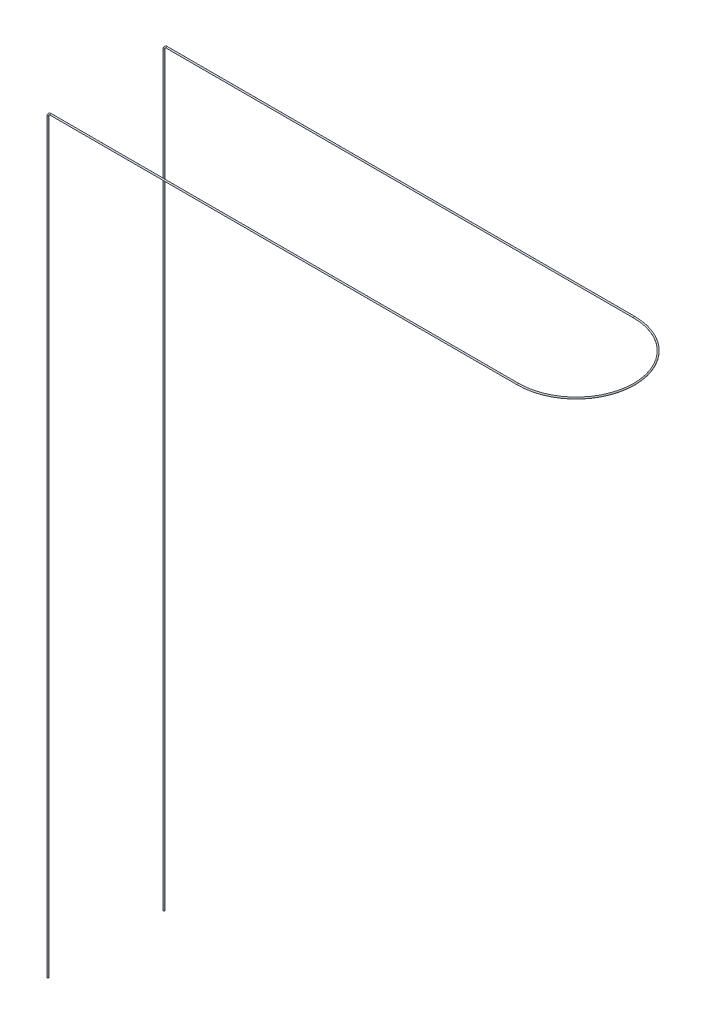
ISO-10303-21;
HEADER;
FILE_DESCRIPTION(('STEP AP214'),'2;1');
FILE_NAME('part.step','',(''),(''),'','','');
FILE_SCHEMA(('AUTOMOTIVE_DESIGN { 1 0 10303 214 1 1 1 1 }'));
ENDSEC;
DATA;
#1=APPLICATION_CONTEXT('core data for automotive mechanical design processes');
#2=APPLICATION_PROTOCOL_DEFINITION('international standard','automotive_design',2000,#1);
#3=PRODUCT_CONTEXT('',#1,'mechanical');
#4=PRODUCT('Part','Part','',(#3));
#5=PRODUCT_RELATED_PRODUCT_CATEGORY('part','',(#4));
#6=PRODUCT_DEFINITION_FORMATION('','',#4);
#7=PRODUCT_DEFINITION_CONTEXT('part definition',#1,'design');
#8=PRODUCT_DEFINITION('design','',#6,#7);
#9=PRODUCT_DEFINITION_SHAPE('','',#8);
#10=(LENGTH_UNIT() NAMED_UNIT(*) SI_UNIT(.MILLI.,.METRE.));
#11=(NAMED_UNIT(*) PLANE_ANGLE_UNIT() SI_UNIT($,.RADIAN.));
#12=(NAMED_UNIT(*) SI_UNIT($,.STERADIAN.) SOLID_ANGLE_UNIT());
#13=UNCERTAINTY_MEASURE_WITH_UNIT(LENGTH_MEASURE(1.E-05),#10,'distance_accuracy_value','');
#14=(GEOMETRIC_REPRESENTATION_CONTEXT(3) GLOBAL_UNCERTAINTY_ASSIGNED_CONTEXT((#13)) GLOBAL_UNIT_ASSIGNED_CONTEXT((#10,
#11,#12)) REPRESENTATION_CONTEXT('',''));
#15=CARTESIAN_POINT('',(0.,0.,0.));
#16=DIRECTION('',(0.,0.,1.));
#17=DIRECTION('',(1.,0.,0.));
#18=AXIS2_PLACEMENT_3D('',#15,#16,#17);
#19=CARTESIAN_POINT('',(0.,0.,0.));
#20=DIRECTION('',(0.,-1.,0.));
#21=DIRECTION('',(0.,0.,-1.));
#22=AXIS2_PLACEMENT_3D('',#19,#20,#21);
#23=PLANE('',#22);
#24=CARTESIAN_POINT('',(0.,0.,0.));
#25=DIRECTION('',(0.,-1.,0.));
#26=DIRECTION('',(0.,0.,-1.));
#27=AXIS2_PLACEMENT_3D('',#24,#25,#26);
#28=CIRCLE('',#27,0.25);
#29=CARTESIAN_POINT('',(0.,0.,-0.25));
#30=VERTEX_POINT('',#29);
#31=EDGE_CURVE('E84',#30,#30,#28,.T.);
#32=ORIENTED_EDGE('',*,*,#31,.T.);
#33=EDGE_LOOP('',(#32));
#34=FACE_BOUND('',#33,.T.);
#35=ADVANCED_FACE('F49',(#34),#23,.T.);
#36=CARTESIAN_POINT('',(0.,0.,-40.0000000000001));
#37=DIRECTION('',(0.,1.,0.));
#38=DIRECTION('',(0.,0.,1.));
#39=AXIS2_PLACEMENT_3D('',#36,#37,#38);
#40=PLANE('',#39);
#41=CARTESIAN_POINT('',(0.,0.,-40.0000000000001));
#42=DIRECTION('',(0.,1.,0.));
#43=DIRECTION('',(0.,0.,1.));
#44=AXIS2_PLACEMENT_3D('',#41,#42,#43);
#45=CIRCLE('',#44,0.25);
#46=CARTESIAN_POINT('',(0.,0.,-39.7500000000001));
#47=VERTEX_POINT('',#46);
#48=EDGE_CURVE('E11',#47,#47,#45,.T.);
#49=ORIENTED_EDGE('',*,*,#48,.F.);
#50=EDGE_LOOP('',(#49));
#51=FACE_BOUND('',#50,.T.);
#52=ADVANCED_FACE('F93',(#51),#40,.F.);
#53=CARTESIAN_POINT('',(0.,0.,0.));
#54=DIRECTION('',(0.,1.,0.));
#55=DIRECTION('',(-1.,0.,0.));
#56=AXIS2_PLACEMENT_3D('',#53,#54,#55);
#57=CYLINDRICAL_SURFACE('',#56,0.25);
#58=CARTESIAN_POINT('',(0.,257.,0.));
#59=DIRECTION('',(0.,-1.,0.));
#60=DIRECTION('',(0.,0.,-1.));
#61=AXIS2_PLACEMENT_3D('',#58,#59,#60);
#62=CIRCLE('',#61,0.25);
#63=CARTESIAN_POINT('',(-0.250000000000012,257.,0.));
#64=VERTEX_POINT('',#63);
#65=EDGE_CURVE('E80',#64,#64,#62,.T.);
#66=ORIENTED_EDGE('',*,*,#65,.T.);
#67=EDGE_LOOP('',(#66));
#68=FACE_BOUND('',#67,.T.);
#69=ORIENTED_EDGE('',*,*,#31,.F.);
#70=EDGE_LOOP('',(#69));
#71=FACE_BOUND('',#70,.T.);
#72=ADVANCED_FACE('F90',(#68,#71),#57,.T.);
#73=CARTESIAN_POINT('',(0.999999999999989,257.,0.));
#74=DIRECTION('',(0.,0.,-1.));
#75=DIRECTION('',(-1.,0.,0.));
#76=AXIS2_PLACEMENT_3D('',#73,#74,#75);
#77=TOROIDAL_SURFACE('',#76,1.,0.25);
#78=CARTESIAN_POINT('',(0.999999999999988,258.,0.));
#79=DIRECTION('',(-1.,0.,0.));
#80=DIRECTION('',(0.,0.,-1.));
#81=AXIS2_PLACEMENT_3D('',#78,#79,#80);
#82=CIRCLE('',#81,0.25);
#83=CARTESIAN_POINT('',(0.999999999999988,258.25,0.));
#84=VERTEX_POINT('',#83);
#85=EDGE_CURVE('E76',#84,#84,#82,.T.);
#86=CARTESIAN_POINT('',(0.999999999999989,257.,0.));
#87=DIRECTION('',(0.,0.,-1.));
#88=DIRECTION('',(-1.,0.,0.));
#89=AXIS2_PLACEMENT_3D('',#86,#87,#88);
#90=CIRCLE('',#89,1.25);
#91=EDGE_CURVE('',#64,#84,#90,.T.);
#92=ORIENTED_EDGE('',*,*,#65,.F.);
#93=ORIENTED_EDGE('',*,*,#85,.T.);
#94=ORIENTED_EDGE('',*,*,#91,.T.);
#95=ORIENTED_EDGE('',*,*,#91,.F.);
#96=EDGE_LOOP('',(#92,#94,#93,#95));
#97=FACE_BOUND('',#96,.T.);
#98=ADVANCED_FACE('F92',(#97),#77,.T.);
#99=CARTESIAN_POINT('',(0.999999999999989,258.,0.));
#100=DIRECTION('',(1.,0.,0.));
#101=DIRECTION('',(0.,1.,0.));
#102=AXIS2_PLACEMENT_3D('',#99,#100,#101);
#103=CYLINDRICAL_SURFACE('',#102,0.25);
#104=CARTESIAN_POINT('',(162.,258.,0.));
#105=DIRECTION('',(-1.,0.,0.));
#106=DIRECTION('',(0.,0.,-1.));
#107=AXIS2_PLACEMENT_3D('',#104,#105,#106);
#108=CIRCLE('',#107,0.25);
#109=CARTESIAN_POINT('',(162.,258.,0.249999999999993));
#110=VERTEX_POINT('',#109);
#111=EDGE_CURVE('E72',#110,#110,#108,.T.);
#112=ORIENTED_EDGE('',*,*,#111,.T.);
#113=EDGE_LOOP('',(#112));
#114=FACE_BOUND('',#113,.T.);
#115=ORIENTED_EDGE('',*,*,#85,.F.);
#116=EDGE_LOOP('',(#115));
#117=FACE_BOUND('',#116,.T.);
#118=ADVANCED_FACE('F100',(#114,#117),#103,.T.);
#119=CARTESIAN_POINT('',(162.,258.,-20.));
#120=DIRECTION('',(0.,1.,0.));
#121=DIRECTION('',(0.,0.,1.));
#122=AXIS2_PLACEMENT_3D('',#119,#120,#121);
#123=TOROIDAL_SURFACE('',#122,20.,0.25);
#124=CARTESIAN_POINT('',(162.,258.,-40.));
#125=DIRECTION('',(1.,0.,0.));
#126=DIRECTION('',(0.,0.,1.));
#127=AXIS2_PLACEMENT_3D('',#124,#125,#126);
#128=CIRCLE('',#127,0.25);
#129=CARTESIAN_POINT('',(162.,258.,-40.25));
#130=VERTEX_POINT('',#129);
#131=EDGE_CURVE('E66',#130,#130,#128,.T.);
#132=CARTESIAN_POINT('',(162.,258.,-20.));
#133=DIRECTION('',(0.,1.,0.));
#134=DIRECTION('',(0.,0.,1.));
#135=AXIS2_PLACEMENT_3D('',#132,#133,#134);
#136=CIRCLE('',#135,20.25);
#137=EDGE_CURVE('',#110,#130,#136,.T.);
#138=ORIENTED_EDGE('',*,*,#111,.F.);
#139=ORIENTED_EDGE('',*,*,#131,.T.);
#140=ORIENTED_EDGE('',*,*,#137,.T.);
#141=ORIENTED_EDGE('',*,*,#137,.F.);
#142=EDGE_LOOP('',(#138,#140,#139,#141));
#143=FACE_BOUND('',#142,.T.);
#144=ADVANCED_FACE('F117',(#143),#123,.T.);
#145=CARTESIAN_POINT('',(162.,258.,-40.));
#146=DIRECTION('',(-1.,0.,0.));
#147=DIRECTION('',(0.,-1.,0.));
#148=AXIS2_PLACEMENT_3D('',#145,#146,#147);
#149=CYLINDRICAL_SURFACE('',#148,0.25);
#150=CARTESIAN_POINT('',(1.,258.,-40.));
#151=DIRECTION('',(1.,0.,0.));
#152=DIRECTION('',(0.,0.,1.));
#153=AXIS2_PLACEMENT_3D('',#150,#151,#152);
#154=CIRCLE('',#153,0.25);
#155=CARTESIAN_POINT('',(1.,258.25,-40.));
#156=VERTEX_POINT('',#155);
#157=EDGE_CURVE('E61',#156,#156,#154,.T.);
#158=ORIENTED_EDGE('',*,*,#157,.T.);
#159=EDGE_LOOP('',(#158));
#160=FACE_BOUND('',#159,.T.);
#161=ORIENTED_EDGE('',*,*,#131,.F.);
#162=EDGE_LOOP('',(#161));
#163=FACE_BOUND('',#162,.T.);
#164=ADVANCED_FACE('F111',(#160,#163),#149,.T.);
#165=CARTESIAN_POINT('',(1.,257.,-40.));
#166=DIRECTION('',(0.,0.,1.));
#167=DIRECTION('',(1.,0.,0.));
#168=AXIS2_PLACEMENT_3D('',#165,#166,#167);
#169=TOROIDAL_SURFACE('',#168,1.,0.25);
#170=CARTESIAN_POINT('',(0.,257.,-40.));
#171=DIRECTION('',(0.,1.,0.));
#172=DIRECTION('',(0.,0.,1.));
#173=AXIS2_PLACEMENT_3D('',#170,#171,#172);
#174=CIRCLE('',#173,0.25);
#175=CARTESIAN_POINT('',(-0.25,257.,-40.));
#176=VERTEX_POINT('',#175);
#177=EDGE_CURVE('E56',#176,#176,#174,.T.);
#178=CARTESIAN_POINT('',(1.,257.,-40.));
#179=DIRECTION('',(0.,0.,1.));
#180=DIRECTION('',(1.,0.,0.));
#181=AXIS2_PLACEMENT_3D('',#178,#179,#180);
#182=CIRCLE('',#181,1.25);
#183=EDGE_CURVE('',#156,#176,#182,.T.);
#184=ORIENTED_EDGE('',*,*,#157,.F.);
#185=ORIENTED_EDGE('',*,*,#177,.T.);
#186=ORIENTED_EDGE('',*,*,#183,.T.);
#187=ORIENTED_EDGE('',*,*,#183,.F.);
#188=EDGE_LOOP('',(#184,#186,#185,#187));
#189=FACE_BOUND('',#188,.T.);
#190=ADVANCED_FACE('F106',(#189),#169,.T.);
#191=CARTESIAN_POINT('',(0.,257.,-40.));
#192=DIRECTION('',(0.,-1.,0.));
#193=DIRECTION('',(0.,0.,-1.));
#194=AXIS2_PLACEMENT_3D('',#191,#192,#193);
#195=CYLINDRICAL_SURFACE('',#194,0.25);
#196=ORIENTED_EDGE('',*,*,#48,.T.);
#197=EDGE_LOOP('',(#196));
#198=FACE_BOUND('',#197,.T.);
#199=ORIENTED_EDGE('',*,*,#177,.F.);
#200=EDGE_LOOP('',(#199));
#201=FACE_BOUND('',#200,.T.);
#202=ADVANCED_FACE('F104',(#198,#201),#195,.T.);
#203=CLOSED_SHELL('',(#35,#52,#72,#98,#118,#144,#164,#190,#202));
#204=MANIFOLD_SOLID_BREP('B2',#203);
#205=ADVANCED_BREP_SHAPE_REPRESENTATION('',(#18,#204),#14);
#206=SHAPE_DEFINITION_REPRESENTATION(#9,#205);
ENDSEC;
END-ISO-10303-21;
